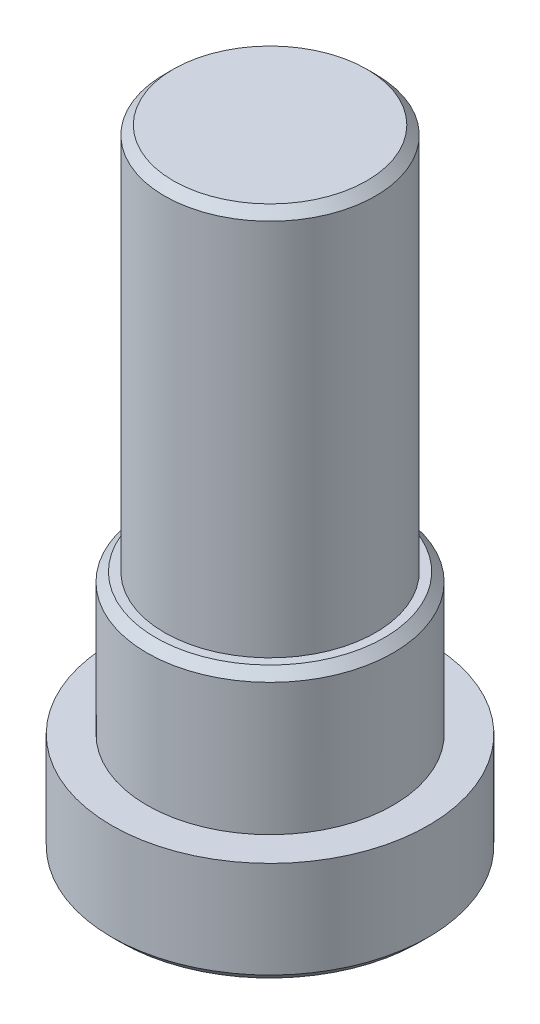
ISO-10303-21;
HEADER;
FILE_DESCRIPTION(('STEP AP214'),'2;1');
FILE_NAME('part.step','',(''),(''),'','','');
FILE_SCHEMA(('AUTOMOTIVE_DESIGN { 1 0 10303 214 1 1 1 1 }'));
ENDSEC;
DATA;
#1=APPLICATION_CONTEXT('core data for automotive mechanical design processes');
#2=APPLICATION_PROTOCOL_DEFINITION('international standard','automotive_design',2000,#1);
#3=PRODUCT_CONTEXT('',#1,'mechanical');
#4=PRODUCT('Part','Part','',(#3));
#5=PRODUCT_RELATED_PRODUCT_CATEGORY('part','',(#4));
#6=PRODUCT_DEFINITION_FORMATION('','',#4);
#7=PRODUCT_DEFINITION_CONTEXT('part definition',#1,'design');
#8=PRODUCT_DEFINITION('design','',#6,#7);
#9=PRODUCT_DEFINITION_SHAPE('','',#8);
#10=(LENGTH_UNIT() NAMED_UNIT(*) SI_UNIT(.MILLI.,.METRE.));
#11=(NAMED_UNIT(*) PLANE_ANGLE_UNIT() SI_UNIT($,.RADIAN.));
#12=(NAMED_UNIT(*) SI_UNIT($,.STERADIAN.) SOLID_ANGLE_UNIT());
#13=UNCERTAINTY_MEASURE_WITH_UNIT(LENGTH_MEASURE(1.E-05),#10,'distance_accuracy_value','');
#14=(GEOMETRIC_REPRESENTATION_CONTEXT(3) GLOBAL_UNCERTAINTY_ASSIGNED_CONTEXT((#13)) GLOBAL_UNIT_ASSIGNED_CONTEXT((#10,
#11,#12)) REPRESENTATION_CONTEXT('',''));
#15=CARTESIAN_POINT('',(0.,0.,0.));
#16=DIRECTION('',(0.,0.,1.));
#17=DIRECTION('',(1.,0.,0.));
#18=AXIS2_PLACEMENT_3D('',#15,#16,#17);
#19=CARTESIAN_POINT('',(2.25,0.,0.));
#20=DIRECTION('',(0.,1.,0.));
#21=DIRECTION('',(0.,0.,1.));
#22=AXIS2_PLACEMENT_3D('',#19,#20,#21);
#23=PLANE('',#22);
#24=CARTESIAN_POINT('',(0.,0.,0.));
#25=DIRECTION('',(0.,1.,0.));
#26=DIRECTION('',(0.,0.,1.));
#27=AXIS2_PLACEMENT_3D('',#24,#25,#26);
#28=CIRCLE('',#27,2.125);
#29=CARTESIAN_POINT('',(0.,0.,2.125));
#30=VERTEX_POINT('',#29);
#31=EDGE_CURVE('E11',#30,#30,#28,.F.);
#32=ORIENTED_EDGE('',*,*,#31,.T.);
#33=EDGE_LOOP('',(#32));
#34=FACE_BOUND('',#33,.T.);
#35=DIRECTION('',(-0.5,0.,0.866025403784438));
#36=VECTOR('',#35,1.);
#37=CARTESIAN_POINT('',(1.15470053837925,0.,0.));
#38=LINE('',#37,#36);
#39=CARTESIAN_POINT('',(1.15470053837925,0.,0.));
#40=VERTEX_POINT('',#39);
#41=CARTESIAN_POINT('',(0.577350269189625,0.,1.));
#42=VERTEX_POINT('',#41);
#43=EDGE_CURVE('E124',#40,#42,#38,.T.);
#44=ORIENTED_EDGE('',*,*,#43,.F.);
#45=DIRECTION('',(0.5,0.,0.866025403784439));
#46=VECTOR('',#45,1.);
#47=CARTESIAN_POINT('',(0.577350269189626,0.,-1.));
#48=LINE('',#47,#46);
#49=CARTESIAN_POINT('',(0.577350269189626,0.,-1.));
#50=VERTEX_POINT('',#49);
#51=EDGE_CURVE('E50',#50,#40,#48,.T.);
#52=ORIENTED_EDGE('',*,*,#51,.F.);
#53=DIRECTION('',(1.,0.,0.));
#54=VECTOR('',#53,1.);
#55=CARTESIAN_POINT('',(-0.577350269189626,0.,-1.));
#56=LINE('',#55,#54);
#57=CARTESIAN_POINT('',(-0.577350269189626,0.,-1.));
#58=VERTEX_POINT('',#57);
#59=EDGE_CURVE('E133',#58,#50,#56,.T.);
#60=ORIENTED_EDGE('',*,*,#59,.F.);
#61=DIRECTION('',(0.5,0.,-0.866025403784439));
#62=VECTOR('',#61,1.);
#63=CARTESIAN_POINT('',(-1.15470053837925,0.,0.));
#64=LINE('',#63,#62);
#65=CARTESIAN_POINT('',(-1.15470053837925,0.,0.));
#66=VERTEX_POINT('',#65);
#67=EDGE_CURVE('E131',#66,#58,#64,.T.);
#68=ORIENTED_EDGE('',*,*,#67,.F.);
#69=DIRECTION('',(-0.5,0.,-0.866025403784439));
#70=VECTOR('',#69,1.);
#71=CARTESIAN_POINT('',(-0.577350269189626,0.,1.));
#72=LINE('',#71,#70);
#73=CARTESIAN_POINT('',(-0.577350269189626,0.,1.));
#74=VERTEX_POINT('',#73);
#75=EDGE_CURVE('E98',#74,#66,#72,.T.);
#76=ORIENTED_EDGE('',*,*,#75,.F.);
#77=DIRECTION('',(-1.,0.,0.));
#78=VECTOR('',#77,1.);
#79=CARTESIAN_POINT('',(0.577350269189625,0.,1.));
#80=LINE('',#79,#78);
#81=EDGE_CURVE('E127',#42,#74,#80,.T.);
#82=ORIENTED_EDGE('',*,*,#81,.F.);
#83=EDGE_LOOP('',(#44,#52,#60,#68,#76,#82));
#84=FACE_BOUND('',#83,.T.);
#85=ADVANCED_FACE('F35',(#34,#84),#23,.F.);
#86=CARTESIAN_POINT('',(0.,9.,0.));
#87=DIRECTION('',(0.,-1.,0.));
#88=DIRECTION('',(0.,0.,-1.));
#89=AXIS2_PLACEMENT_3D('',#86,#87,#88);
#90=PLANE('',#89);
#91=CARTESIAN_POINT('',(0.,9.,0.));
#92=DIRECTION('',(0.,-1.,0.));
#93=DIRECTION('',(0.,0.,-1.));
#94=AXIS2_PLACEMENT_3D('',#91,#92,#93);
#95=CIRCLE('',#94,1.375);
#96=CARTESIAN_POINT('',(0.,9.,-1.375));
#97=VERTEX_POINT('',#96);
#98=EDGE_CURVE('E151',#97,#97,#95,.F.);
#99=ORIENTED_EDGE('',*,*,#98,.T.);
#100=EDGE_LOOP('',(#99));
#101=FACE_BOUND('',#100,.T.);
#102=ADVANCED_FACE('F178',(#101),#90,.F.);
#103=CARTESIAN_POINT('',(0.,0.,0.));
#104=DIRECTION('',(0.,1.,0.));
#105=DIRECTION('',(0.,0.,1.));
#106=AXIS2_PLACEMENT_3D('',#103,#104,#105);
#107=CYLINDRICAL_SURFACE('',#106,1.5);
#108=CARTESIAN_POINT('',(0.,8.875,0.));
#109=DIRECTION('',(0.,-1.,0.));
#110=DIRECTION('',(0.,0.,-1.));
#111=AXIS2_PLACEMENT_3D('',#108,#109,#110);
#112=CIRCLE('',#111,1.5);
#113=CARTESIAN_POINT('',(0.,8.875,-1.5));
#114=VERTEX_POINT('',#113);
#115=EDGE_CURVE('E154',#114,#114,#112,.T.);
#116=ORIENTED_EDGE('',*,*,#115,.T.);
#117=EDGE_LOOP('',(#116));
#118=FACE_BOUND('',#117,.T.);
#119=CARTESIAN_POINT('',(0.,3.5,0.));
#120=DIRECTION('',(0.,1.,0.));
#121=DIRECTION('',(0.,0.,1.));
#122=AXIS2_PLACEMENT_3D('',#119,#120,#121);
#123=CIRCLE('',#122,1.5);
#124=CARTESIAN_POINT('',(0.,3.5,1.5));
#125=VERTEX_POINT('',#124);
#126=EDGE_CURVE('E148',#125,#125,#123,.T.);
#127=ORIENTED_EDGE('',*,*,#126,.T.);
#128=EDGE_LOOP('',(#127));
#129=FACE_BOUND('',#128,.T.);
#130=ADVANCED_FACE('F184',(#118,#129),#107,.T.);
#131=CARTESIAN_POINT('',(1.5,3.5,0.));
#132=DIRECTION('',(0.,-1.,0.));
#133=DIRECTION('',(0.,0.,-1.));
#134=AXIS2_PLACEMENT_3D('',#131,#132,#133);
#135=PLANE('',#134);
#136=CARTESIAN_POINT('',(0.,3.5,0.));
#137=DIRECTION('',(0.,-1.,0.));
#138=DIRECTION('',(0.,0.,-1.));
#139=AXIS2_PLACEMENT_3D('',#136,#137,#138);
#140=CIRCLE('',#139,1.625);
#141=CARTESIAN_POINT('',(0.,3.5,-1.625));
#142=VERTEX_POINT('',#141);
#143=EDGE_CURVE('E157',#142,#142,#140,.F.);
#144=ORIENTED_EDGE('',*,*,#143,.T.);
#145=EDGE_LOOP('',(#144));
#146=FACE_BOUND('',#145,.T.);
#147=ORIENTED_EDGE('',*,*,#126,.F.);
#148=EDGE_LOOP('',(#147));
#149=FACE_BOUND('',#148,.T.);
#150=ADVANCED_FACE('F203',(#146,#149),#135,.F.);
#151=CARTESIAN_POINT('',(0.,0.,0.));
#152=DIRECTION('',(0.,1.,0.));
#153=DIRECTION('',(0.,0.,1.));
#154=AXIS2_PLACEMENT_3D('',#151,#152,#153);
#155=CYLINDRICAL_SURFACE('',#154,1.75);
#156=CARTESIAN_POINT('',(0.,3.375,0.));
#157=DIRECTION('',(0.,-1.,0.));
#158=DIRECTION('',(0.,0.,-1.));
#159=AXIS2_PLACEMENT_3D('',#156,#157,#158);
#160=CIRCLE('',#159,1.75);
#161=CARTESIAN_POINT('',(0.,3.375,-1.75));
#162=VERTEX_POINT('',#161);
#163=EDGE_CURVE('E160',#162,#162,#160,.T.);
#164=ORIENTED_EDGE('',*,*,#163,.T.);
#165=EDGE_LOOP('',(#164));
#166=FACE_BOUND('',#165,.T.);
#167=CARTESIAN_POINT('',(0.,1.5,0.));
#168=DIRECTION('',(0.,1.,0.));
#169=DIRECTION('',(0.,0.,1.));
#170=AXIS2_PLACEMENT_3D('',#167,#168,#169);
#171=CIRCLE('',#170,1.75);
#172=CARTESIAN_POINT('',(0.,1.5,1.75));
#173=VERTEX_POINT('',#172);
#174=EDGE_CURVE('E145',#173,#173,#171,.T.);
#175=ORIENTED_EDGE('',*,*,#174,.T.);
#176=EDGE_LOOP('',(#175));
#177=FACE_BOUND('',#176,.T.);
#178=ADVANCED_FACE('F207',(#166,#177),#155,.T.);
#179=CARTESIAN_POINT('',(1.75,1.5,0.));
#180=DIRECTION('',(0.,-1.,0.));
#181=DIRECTION('',(0.,0.,-1.));
#182=AXIS2_PLACEMENT_3D('',#179,#180,#181);
#183=PLANE('',#182);
#184=ORIENTED_EDGE('',*,*,#174,.F.);
#185=EDGE_LOOP('',(#184));
#186=FACE_BOUND('',#185,.T.);
#187=CARTESIAN_POINT('',(0.,1.5,0.));
#188=DIRECTION('',(0.,1.,0.));
#189=DIRECTION('',(0.,0.,1.));
#190=AXIS2_PLACEMENT_3D('',#187,#188,#189);
#191=CIRCLE('',#190,2.25);
#192=CARTESIAN_POINT('',(0.,1.5,2.25));
#193=VERTEX_POINT('',#192);
#194=EDGE_CURVE('E137',#193,#193,#191,.T.);
#195=ORIENTED_EDGE('',*,*,#194,.T.);
#196=EDGE_LOOP('',(#195));
#197=FACE_BOUND('',#196,.T.);
#198=ADVANCED_FACE('F213',(#186,#197),#183,.F.);
#199=CARTESIAN_POINT('',(0.,0.,0.));
#200=DIRECTION('',(0.,1.,0.));
#201=DIRECTION('',(0.,0.,1.));
#202=AXIS2_PLACEMENT_3D('',#199,#200,#201);
#203=CYLINDRICAL_SURFACE('',#202,2.25);
#204=CARTESIAN_POINT('',(0.,0.125000000000001,0.));
#205=DIRECTION('',(0.,1.,0.));
#206=DIRECTION('',(0.,0.,1.));
#207=AXIS2_PLACEMENT_3D('',#204,#205,#206);
#208=CIRCLE('',#207,2.25);
#209=CARTESIAN_POINT('',(0.,0.125000000000001,2.25));
#210=VERTEX_POINT('',#209);
#211=EDGE_CURVE('E43',#210,#210,#208,.T.);
#212=ORIENTED_EDGE('',*,*,#211,.T.);
#213=EDGE_LOOP('',(#212));
#214=FACE_BOUND('',#213,.T.);
#215=ORIENTED_EDGE('',*,*,#194,.F.);
#216=EDGE_LOOP('',(#215));
#217=FACE_BOUND('',#216,.T.);
#218=ADVANCED_FACE('F165',(#214,#217),#203,.T.);
#219=CARTESIAN_POINT('',(0.577350269189626,1.,-1.));
#220=DIRECTION('',(0.866025403784438,0.,-0.5));
#221=DIRECTION('',(-0.5,0.,-0.866025403784439));
#222=AXIS2_PLACEMENT_3D('',#219,#220,#221);
#223=PLANE('',#222);
#224=ORIENTED_EDGE('',*,*,#51,.T.);
#225=DIRECTION('',(0.,-1.,0.));
#226=VECTOR('',#225,1.);
#227=CARTESIAN_POINT('',(1.15470053837925,1.,0.));
#228=LINE('',#227,#226);
#229=CARTESIAN_POINT('',(1.15470053837925,1.,0.));
#230=VERTEX_POINT('',#229);
#231=EDGE_CURVE('E80',#230,#40,#228,.T.);
#232=ORIENTED_EDGE('',*,*,#231,.F.);
#233=DIRECTION('',(0.5,0.,0.866025403784439));
#234=VECTOR('',#233,1.);
#235=CARTESIAN_POINT('',(0.577350269189626,1.,-1.));
#236=LINE('',#235,#234);
#237=CARTESIAN_POINT('',(0.577350269189626,1.,-1.));
#238=VERTEX_POINT('',#237);
#239=EDGE_CURVE('E135',#238,#230,#236,.T.);
#240=ORIENTED_EDGE('',*,*,#239,.F.);
#241=DIRECTION('',(0.,-1.,0.));
#242=VECTOR('',#241,1.);
#243=CARTESIAN_POINT('',(0.577350269189626,1.,-1.));
#244=LINE('',#243,#242);
#245=EDGE_CURVE('E58',#238,#50,#244,.T.);
#246=ORIENTED_EDGE('',*,*,#245,.T.);
#247=EDGE_LOOP('',(#224,#232,#240,#246));
#248=FACE_BOUND('',#247,.T.);
#249=ADVANCED_FACE('F222',(#248),#223,.F.);
#250=CARTESIAN_POINT('',(-0.577350269189626,1.,-1.));
#251=DIRECTION('',(0.,0.,-1.));
#252=DIRECTION('',(-1.,0.,0.));
#253=AXIS2_PLACEMENT_3D('',#250,#251,#252);
#254=PLANE('',#253);
#255=ORIENTED_EDGE('',*,*,#59,.T.);
#256=ORIENTED_EDGE('',*,*,#245,.F.);
#257=DIRECTION('',(1.,0.,0.));
#258=VECTOR('',#257,1.);
#259=CARTESIAN_POINT('',(-0.577350269189626,1.,-1.));
#260=LINE('',#259,#258);
#261=CARTESIAN_POINT('',(-0.577350269189626,1.,-1.));
#262=VERTEX_POINT('',#261);
#263=EDGE_CURVE('E110',#262,#238,#260,.T.);
#264=ORIENTED_EDGE('',*,*,#263,.F.);
#265=DIRECTION('',(0.,-1.,0.));
#266=VECTOR('',#265,1.);
#267=CARTESIAN_POINT('',(-0.577350269189626,1.,-1.));
#268=LINE('',#267,#266);
#269=EDGE_CURVE('E102',#262,#58,#268,.T.);
#270=ORIENTED_EDGE('',*,*,#269,.T.);
#271=EDGE_LOOP('',(#255,#256,#264,#270));
#272=FACE_BOUND('',#271,.T.);
#273=ADVANCED_FACE('F225',(#272),#254,.F.);
#274=CARTESIAN_POINT('',(-1.15470053837925,1.,0.));
#275=DIRECTION('',(-0.866025403784439,0.,-0.5));
#276=DIRECTION('',(-0.5,0.,0.866025403784439));
#277=AXIS2_PLACEMENT_3D('',#274,#275,#276);
#278=PLANE('',#277);
#279=ORIENTED_EDGE('',*,*,#67,.T.);
#280=ORIENTED_EDGE('',*,*,#269,.F.);
#281=DIRECTION('',(0.5,0.,-0.866025403784439));
#282=VECTOR('',#281,1.);
#283=CARTESIAN_POINT('',(-1.15470053837925,1.,0.));
#284=LINE('',#283,#282);
#285=CARTESIAN_POINT('',(-1.15470053837925,1.,0.));
#286=VERTEX_POINT('',#285);
#287=EDGE_CURVE('E106',#286,#262,#284,.T.);
#288=ORIENTED_EDGE('',*,*,#287,.F.);
#289=DIRECTION('',(0.,-1.,0.));
#290=VECTOR('',#289,1.);
#291=CARTESIAN_POINT('',(-1.15470053837925,1.,0.));
#292=LINE('',#291,#290);
#293=EDGE_CURVE('E91',#286,#66,#292,.T.);
#294=ORIENTED_EDGE('',*,*,#293,.T.);
#295=EDGE_LOOP('',(#279,#280,#288,#294));
#296=FACE_BOUND('',#295,.T.);
#297=ADVANCED_FACE('F107',(#296),#278,.F.);
#298=CARTESIAN_POINT('',(-0.577350269189626,1.,1.));
#299=DIRECTION('',(-0.866025403784439,0.,0.5));
#300=DIRECTION('',(0.5,0.,0.866025403784439));
#301=AXIS2_PLACEMENT_3D('',#298,#299,#300);
#302=PLANE('',#301);
#303=ORIENTED_EDGE('',*,*,#75,.T.);
#304=ORIENTED_EDGE('',*,*,#293,.F.);
#305=DIRECTION('',(-0.5,0.,-0.866025403784439));
#306=VECTOR('',#305,1.);
#307=CARTESIAN_POINT('',(-0.577350269189626,1.,1.));
#308=LINE('',#307,#306);
#309=CARTESIAN_POINT('',(-0.577350269189626,1.,1.));
#310=VERTEX_POINT('',#309);
#311=EDGE_CURVE('E95',#310,#286,#308,.T.);
#312=ORIENTED_EDGE('',*,*,#311,.F.);
#313=DIRECTION('',(0.,-1.,0.));
#314=VECTOR('',#313,1.);
#315=CARTESIAN_POINT('',(-0.577350269189626,1.,1.));
#316=LINE('',#315,#314);
#317=EDGE_CURVE('E103',#310,#74,#316,.T.);
#318=ORIENTED_EDGE('',*,*,#317,.T.);
#319=EDGE_LOOP('',(#303,#304,#312,#318));
#320=FACE_BOUND('',#319,.T.);
#321=ADVANCED_FACE('F93',(#320),#302,.F.);
#322=CARTESIAN_POINT('',(0.577350269189625,1.,1.));
#323=DIRECTION('',(0.,0.,1.));
#324=DIRECTION('',(1.,0.,0.));
#325=AXIS2_PLACEMENT_3D('',#322,#323,#324);
#326=PLANE('',#325);
#327=ORIENTED_EDGE('',*,*,#81,.T.);
#328=ORIENTED_EDGE('',*,*,#317,.F.);
#329=DIRECTION('',(-1.,0.,0.));
#330=VECTOR('',#329,1.);
#331=CARTESIAN_POINT('',(0.577350269189625,1.,1.));
#332=LINE('',#331,#330);
#333=CARTESIAN_POINT('',(0.577350269189625,1.,1.));
#334=VERTEX_POINT('',#333);
#335=EDGE_CURVE('E116',#334,#310,#332,.T.);
#336=ORIENTED_EDGE('',*,*,#335,.F.);
#337=DIRECTION('',(0.,-1.,0.));
#338=VECTOR('',#337,1.);
#339=CARTESIAN_POINT('',(0.577350269189625,1.,1.));
#340=LINE('',#339,#338);
#341=EDGE_CURVE('E140',#334,#42,#340,.T.);
#342=ORIENTED_EDGE('',*,*,#341,.T.);
#343=EDGE_LOOP('',(#327,#328,#336,#342));
#344=FACE_BOUND('',#343,.T.);
#345=ADVANCED_FACE('F228',(#344),#326,.F.);
#346=CARTESIAN_POINT('',(1.15470053837925,1.,0.));
#347=DIRECTION('',(0.866025403784438,0.,0.5));
#348=DIRECTION('',(0.5,0.,-0.866025403784438));
#349=AXIS2_PLACEMENT_3D('',#346,#347,#348);
#350=PLANE('',#349);
#351=ORIENTED_EDGE('',*,*,#43,.T.);
#352=ORIENTED_EDGE('',*,*,#341,.F.);
#353=DIRECTION('',(-0.5,0.,0.866025403784438));
#354=VECTOR('',#353,1.);
#355=CARTESIAN_POINT('',(1.15470053837925,1.,0.));
#356=LINE('',#355,#354);
#357=EDGE_CURVE('E118',#230,#334,#356,.T.);
#358=ORIENTED_EDGE('',*,*,#357,.F.);
#359=ORIENTED_EDGE('',*,*,#231,.T.);
#360=EDGE_LOOP('',(#351,#352,#358,#359));
#361=FACE_BOUND('',#360,.T.);
#362=ADVANCED_FACE('F195',(#361),#350,.F.);
#363=CARTESIAN_POINT('',(0.,1.,0.));
#364=DIRECTION('',(0.,-1.,0.));
#365=DIRECTION('',(0.,0.,-1.));
#366=AXIS2_PLACEMENT_3D('',#363,#364,#365);
#367=PLANE('',#366);
#368=ORIENTED_EDGE('',*,*,#239,.T.);
#369=ORIENTED_EDGE('',*,*,#357,.T.);
#370=ORIENTED_EDGE('',*,*,#335,.T.);
#371=ORIENTED_EDGE('',*,*,#311,.T.);
#372=ORIENTED_EDGE('',*,*,#287,.T.);
#373=ORIENTED_EDGE('',*,*,#263,.T.);
#374=EDGE_LOOP('',(#368,#369,#370,#371,#372,#373));
#375=FACE_BOUND('',#374,.T.);
#376=ADVANCED_FACE('F113',(#375),#367,.T.);
#377=CARTESIAN_POINT('',(0.,9.,0.));
#378=DIRECTION('',(0.,-1.,0.));
#379=DIRECTION('',(0.,0.,-1.));
#380=AXIS2_PLACEMENT_3D('',#377,#378,#379);
#381=CONICAL_SURFACE('',#380,1.375,0.785398163397453);
#382=ORIENTED_EDGE('',*,*,#115,.F.);
#383=EDGE_LOOP('',(#382));
#384=FACE_BOUND('',#383,.T.);
#385=ORIENTED_EDGE('',*,*,#98,.F.);
#386=EDGE_LOOP('',(#385));
#387=FACE_BOUND('',#386,.T.);
#388=ADVANCED_FACE('F174',(#384,#387),#381,.T.);
#389=CARTESIAN_POINT('',(0.,3.5,0.));
#390=DIRECTION('',(0.,-1.,0.));
#391=DIRECTION('',(0.,0.,-1.));
#392=AXIS2_PLACEMENT_3D('',#389,#390,#391);
#393=CONICAL_SURFACE('',#392,1.625,0.785398163397448);
#394=ORIENTED_EDGE('',*,*,#163,.F.);
#395=EDGE_LOOP('',(#394));
#396=FACE_BOUND('',#395,.T.);
#397=ORIENTED_EDGE('',*,*,#143,.F.);
#398=EDGE_LOOP('',(#397));
#399=FACE_BOUND('',#398,.T.);
#400=ADVANCED_FACE('F169',(#396,#399),#393,.T.);
#401=CARTESIAN_POINT('',(0.,0.125000000000001,0.));
#402=DIRECTION('',(0.,1.,0.));
#403=DIRECTION('',(0.,0.,1.));
#404=AXIS2_PLACEMENT_3D('',#401,#402,#403);
#405=CONICAL_SURFACE('',#404,2.25,0.785398163397447);
#406=ORIENTED_EDGE('',*,*,#31,.F.);
#407=EDGE_LOOP('',(#406));
#408=FACE_BOUND('',#407,.T.);
#409=ORIENTED_EDGE('',*,*,#211,.F.);
#410=EDGE_LOOP('',(#409));
#411=FACE_BOUND('',#410,.T.);
#412=ADVANCED_FACE('F37',(#408,#411),#405,.T.);
#413=CLOSED_SHELL('',(#85,#102,#130,#150,#178,#198,#218,#249,#273,#297,#321,#345,#362,#376,#388,
#400,#412));
#414=MANIFOLD_SOLID_BREP('B2',#413);
#415=ADVANCED_BREP_SHAPE_REPRESENTATION('',(#18,#414),#14);
#416=SHAPE_DEFINITION_REPRESENTATION(#9,#415);
ENDSEC;
END-ISO-10303-21;
